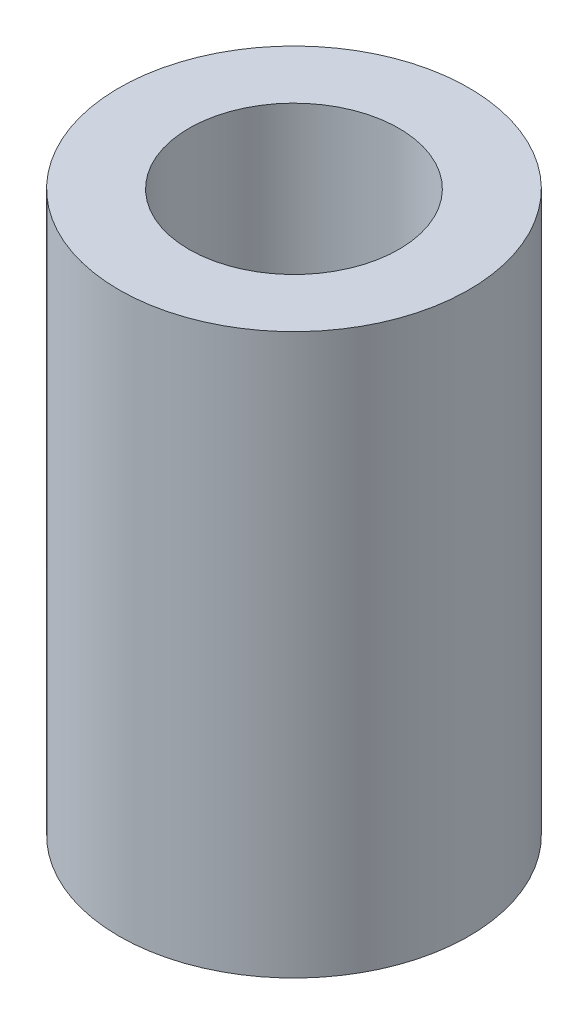
ISO-10303-21;
HEADER;
FILE_DESCRIPTION(('STEP AP214'),'2;1');
FILE_NAME('part.step','',(''),(''),'','','');
FILE_SCHEMA(('AUTOMOTIVE_DESIGN { 1 0 10303 214 1 1 1 1 }'));
ENDSEC;
DATA;
#1=APPLICATION_CONTEXT('core data for automotive mechanical design processes');
#2=APPLICATION_PROTOCOL_DEFINITION('international standard','automotive_design',2000,#1);
#3=PRODUCT_CONTEXT('',#1,'mechanical');
#4=PRODUCT('Part','Part','',(#3));
#5=PRODUCT_RELATED_PRODUCT_CATEGORY('part','',(#4));
#6=PRODUCT_DEFINITION_FORMATION('','',#4);
#7=PRODUCT_DEFINITION_CONTEXT('part definition',#1,'design');
#8=PRODUCT_DEFINITION('design','',#6,#7);
#9=PRODUCT_DEFINITION_SHAPE('','',#8);
#10=(LENGTH_UNIT() NAMED_UNIT(*) SI_UNIT(.MILLI.,.METRE.));
#11=(NAMED_UNIT(*) PLANE_ANGLE_UNIT() SI_UNIT($,.RADIAN.));
#12=(NAMED_UNIT(*) SI_UNIT($,.STERADIAN.) SOLID_ANGLE_UNIT());
#13=UNCERTAINTY_MEASURE_WITH_UNIT(LENGTH_MEASURE(1.E-05),#10,'distance_accuracy_value','');
#14=(GEOMETRIC_REPRESENTATION_CONTEXT(3) GLOBAL_UNCERTAINTY_ASSIGNED_CONTEXT((#13)) GLOBAL_UNIT_ASSIGNED_CONTEXT((#10,
#11,#12)) REPRESENTATION_CONTEXT('',''));
#15=CARTESIAN_POINT('',(0.,0.,0.));
#16=DIRECTION('',(0.,0.,1.));
#17=DIRECTION('',(1.,0.,0.));
#18=AXIS2_PLACEMENT_3D('',#15,#16,#17);
#19=CARTESIAN_POINT('',(0.,4.,0.));
#20=DIRECTION('',(0.,1.,0.));
#21=DIRECTION('',(0.,0.,1.));
#22=AXIS2_PLACEMENT_3D('',#19,#20,#21);
#23=PLANE('',#22);
#24=CARTESIAN_POINT('',(0.,4.,0.));
#25=DIRECTION('',(0.,1.,0.));
#26=DIRECTION('',(0.,0.,1.));
#27=AXIS2_PLACEMENT_3D('',#24,#25,#26);
#28=CIRCLE('',#27,1.25);
#29=CARTESIAN_POINT('',(0.,4.,1.25));
#30=VERTEX_POINT('',#29);
#31=EDGE_CURVE('E10',#30,#30,#28,.T.);
#32=ORIENTED_EDGE('',*,*,#31,.T.);
#33=EDGE_LOOP('',(#32));
#34=FACE_BOUND('',#33,.T.);
#35=CARTESIAN_POINT('',(0.,4.,0.));
#36=DIRECTION('',(0.,1.,0.));
#37=DIRECTION('',(0.,0.,1.));
#38=AXIS2_PLACEMENT_3D('',#35,#36,#37);
#39=CIRCLE('',#38,0.75);
#40=CARTESIAN_POINT('',(0.,4.,0.75));
#41=VERTEX_POINT('',#40);
#42=EDGE_CURVE('E43',#41,#41,#39,.T.);
#43=ORIENTED_EDGE('',*,*,#42,.F.);
#44=EDGE_LOOP('',(#43));
#45=FACE_BOUND('',#44,.T.);
#46=ADVANCED_FACE('F32',(#34,#45),#23,.T.);
#47=CARTESIAN_POINT('',(0.,0.,0.));
#48=DIRECTION('',(0.,1.,0.));
#49=DIRECTION('',(0.,0.,1.));
#50=AXIS2_PLACEMENT_3D('',#47,#48,#49);
#51=PLANE('',#50);
#52=CARTESIAN_POINT('',(0.,0.,0.));
#53=DIRECTION('',(0.,1.,0.));
#54=DIRECTION('',(0.,0.,1.));
#55=AXIS2_PLACEMENT_3D('',#52,#53,#54);
#56=CIRCLE('',#55,1.25);
#57=CARTESIAN_POINT('',(0.,0.,1.25));
#58=VERTEX_POINT('',#57);
#59=EDGE_CURVE('E36',#58,#58,#56,.T.);
#60=ORIENTED_EDGE('',*,*,#59,.F.);
#61=EDGE_LOOP('',(#60));
#62=FACE_BOUND('',#61,.T.);
#63=CARTESIAN_POINT('',(0.,0.,0.));
#64=DIRECTION('',(0.,1.,0.));
#65=DIRECTION('',(0.,0.,1.));
#66=AXIS2_PLACEMENT_3D('',#63,#64,#65);
#67=CIRCLE('',#66,0.75);
#68=CARTESIAN_POINT('',(0.,0.,0.75));
#69=VERTEX_POINT('',#68);
#70=EDGE_CURVE('E45',#69,#69,#67,.T.);
#71=ORIENTED_EDGE('',*,*,#70,.T.);
#72=EDGE_LOOP('',(#71));
#73=FACE_BOUND('',#72,.T.);
#74=ADVANCED_FACE('F55',(#62,#73),#51,.F.);
#75=CARTESIAN_POINT('',(0.,4.,0.));
#76=DIRECTION('',(0.,-1.,0.));
#77=DIRECTION('',(0.,0.,-1.));
#78=AXIS2_PLACEMENT_3D('',#75,#76,#77);
#79=CYLINDRICAL_SURFACE('',#78,1.25);
#80=ORIENTED_EDGE('',*,*,#31,.F.);
#81=EDGE_LOOP('',(#80));
#82=FACE_BOUND('',#81,.T.);
#83=ORIENTED_EDGE('',*,*,#59,.T.);
#84=EDGE_LOOP('',(#83));
#85=FACE_BOUND('',#84,.T.);
#86=ADVANCED_FACE('F34',(#82,#85),#79,.T.);
#87=CARTESIAN_POINT('',(0.,4.,0.));
#88=DIRECTION('',(0.,-1.,0.));
#89=DIRECTION('',(0.,0.,-1.));
#90=AXIS2_PLACEMENT_3D('',#87,#88,#89);
#91=CYLINDRICAL_SURFACE('',#90,0.75);
#92=ORIENTED_EDGE('',*,*,#42,.T.);
#93=EDGE_LOOP('',(#92));
#94=FACE_BOUND('',#93,.T.);
#95=ORIENTED_EDGE('',*,*,#70,.F.);
#96=EDGE_LOOP('',(#95));
#97=FACE_BOUND('',#96,.T.);
#98=ADVANCED_FACE('F51',(#94,#97),#91,.F.);
#99=CLOSED_SHELL('',(#46,#74,#86,#98));
#100=MANIFOLD_SOLID_BREP('B2',#99);
#101=ADVANCED_BREP_SHAPE_REPRESENTATION('',(#18,#100),#14);
#102=SHAPE_DEFINITION_REPRESENTATION(#9,#101);
ENDSEC;
END-ISO-10303-21;
